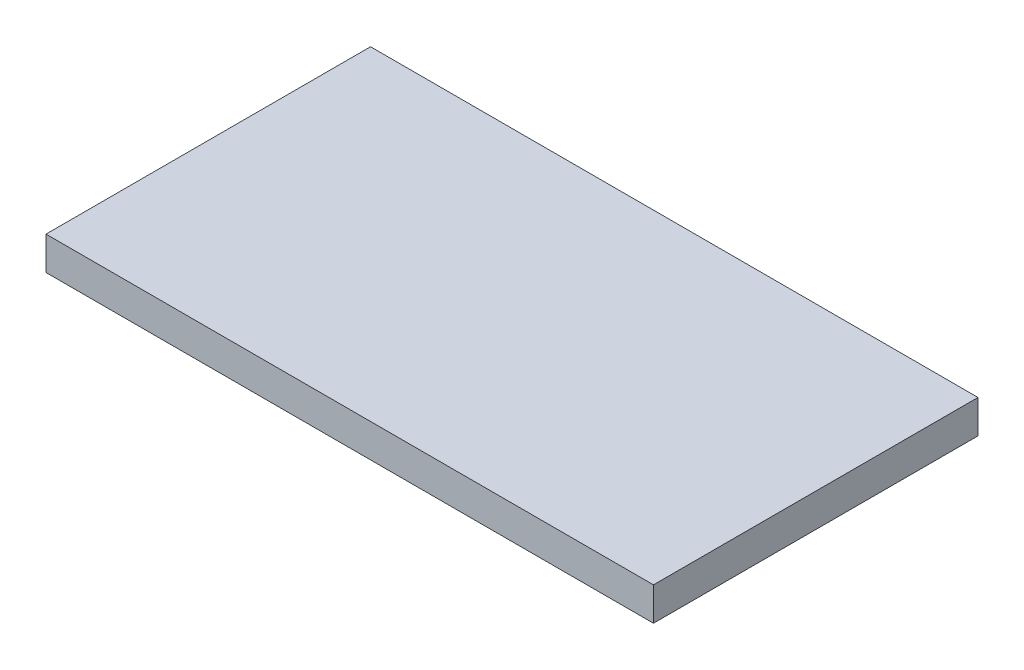
ISO-10303-21;
HEADER;
FILE_DESCRIPTION(('STEP AP214'),'2;1');
FILE_NAME('part.step','',(''),(''),'','','');
FILE_SCHEMA(('AUTOMOTIVE_DESIGN { 1 0 10303 214 1 1 1 1 }'));
ENDSEC;
DATA;
#1=APPLICATION_CONTEXT('core data for automotive mechanical design processes');
#2=APPLICATION_PROTOCOL_DEFINITION('international standard','automotive_design',2000,#1);
#3=PRODUCT_CONTEXT('',#1,'mechanical');
#4=PRODUCT('Part','Part','',(#3));
#5=PRODUCT_RELATED_PRODUCT_CATEGORY('part','',(#4));
#6=PRODUCT_DEFINITION_FORMATION('','',#4);
#7=PRODUCT_DEFINITION_CONTEXT('part definition',#1,'design');
#8=PRODUCT_DEFINITION('design','',#6,#7);
#9=PRODUCT_DEFINITION_SHAPE('','',#8);
#10=(LENGTH_UNIT() NAMED_UNIT(*) SI_UNIT(.MILLI.,.METRE.));
#11=(NAMED_UNIT(*) PLANE_ANGLE_UNIT() SI_UNIT($,.RADIAN.));
#12=(NAMED_UNIT(*) SI_UNIT($,.STERADIAN.) SOLID_ANGLE_UNIT());
#13=UNCERTAINTY_MEASURE_WITH_UNIT(LENGTH_MEASURE(1.E-05),#10,'distance_accuracy_value','');
#14=(GEOMETRIC_REPRESENTATION_CONTEXT(3) GLOBAL_UNCERTAINTY_ASSIGNED_CONTEXT((#13)) GLOBAL_UNIT_ASSIGNED_CONTEXT((#10,
#11,#12)) REPRESENTATION_CONTEXT('',''));
#15=CARTESIAN_POINT('',(0.,0.,0.));
#16=DIRECTION('',(0.,0.,1.));
#17=DIRECTION('',(1.,0.,0.));
#18=AXIS2_PLACEMENT_3D('',#15,#16,#17);
#19=CARTESIAN_POINT('',(18.25,2.,9.75));
#20=DIRECTION('',(-1.,0.,0.));
#21=DIRECTION('',(0.,0.,1.));
#22=AXIS2_PLACEMENT_3D('',#19,#20,#21);
#23=PLANE('',#22);
#24=DIRECTION('',(0.,0.,-1.));
#25=VECTOR('',#24,1.);
#26=CARTESIAN_POINT('',(18.25,0.,9.75));
#27=LINE('',#26,#25);
#28=CARTESIAN_POINT('',(18.25,0.,9.75));
#29=VERTEX_POINT('',#28);
#30=CARTESIAN_POINT('',(18.25,0.,-9.75));
#31=VERTEX_POINT('',#30);
#32=EDGE_CURVE('E96',#29,#31,#27,.T.);
#33=ORIENTED_EDGE('',*,*,#32,.T.);
#34=DIRECTION('',(0.,-1.,0.));
#35=VECTOR('',#34,1.);
#36=CARTESIAN_POINT('',(18.25,2.,-9.75));
#37=LINE('',#36,#35);
#38=CARTESIAN_POINT('',(18.25,2.,-9.75));
#39=VERTEX_POINT('',#38);
#40=EDGE_CURVE('E11',#39,#31,#37,.T.);
#41=ORIENTED_EDGE('',*,*,#40,.F.);
#42=DIRECTION('',(0.,0.,-1.));
#43=VECTOR('',#42,1.);
#44=CARTESIAN_POINT('',(18.25,2.,9.75));
#45=LINE('',#44,#43);
#46=CARTESIAN_POINT('',(18.25,2.,9.75));
#47=VERTEX_POINT('',#46);
#48=EDGE_CURVE('E84',#47,#39,#45,.T.);
#49=ORIENTED_EDGE('',*,*,#48,.F.);
#50=DIRECTION('',(0.,-1.,0.));
#51=VECTOR('',#50,1.);
#52=CARTESIAN_POINT('',(18.25,2.,9.75));
#53=LINE('',#52,#51);
#54=EDGE_CURVE('E92',#47,#29,#53,.T.);
#55=ORIENTED_EDGE('',*,*,#54,.T.);
#56=EDGE_LOOP('',(#33,#41,#49,#55));
#57=FACE_BOUND('',#56,.T.);
#58=ADVANCED_FACE('F33',(#57),#23,.F.);
#59=CARTESIAN_POINT('',(-18.25,2.,-9.75));
#60=DIRECTION('',(0.,0.,1.));
#61=DIRECTION('',(1.,0.,0.));
#62=AXIS2_PLACEMENT_3D('',#59,#60,#61);
#63=PLANE('',#62);
#64=DIRECTION('',(-1.,0.,0.));
#65=VECTOR('',#64,1.);
#66=CARTESIAN_POINT('',(-18.25,0.,-9.75));
#67=LINE('',#66,#65);
#68=CARTESIAN_POINT('',(-18.25,0.,-9.75));
#69=VERTEX_POINT('',#68);
#70=EDGE_CURVE('E88',#31,#69,#67,.T.);
#71=ORIENTED_EDGE('',*,*,#70,.T.);
#72=DIRECTION('',(0.,-1.,0.));
#73=VECTOR('',#72,1.);
#74=CARTESIAN_POINT('',(-18.25,2.,-9.75));
#75=LINE('',#74,#73);
#76=CARTESIAN_POINT('',(-18.25,2.,-9.75));
#77=VERTEX_POINT('',#76);
#78=EDGE_CURVE('E41',#77,#69,#75,.T.);
#79=ORIENTED_EDGE('',*,*,#78,.F.);
#80=DIRECTION('',(-1.,0.,0.));
#81=VECTOR('',#80,1.);
#82=CARTESIAN_POINT('',(-18.25,2.,-9.75));
#83=LINE('',#82,#81);
#84=EDGE_CURVE('E79',#39,#77,#83,.T.);
#85=ORIENTED_EDGE('',*,*,#84,.F.);
#86=ORIENTED_EDGE('',*,*,#40,.T.);
#87=EDGE_LOOP('',(#71,#79,#85,#86));
#88=FACE_BOUND('',#87,.T.);
#89=ADVANCED_FACE('F87',(#88),#63,.F.);
#90=CARTESIAN_POINT('',(-18.25,2.,9.75));
#91=DIRECTION('',(1.,0.,0.));
#92=DIRECTION('',(0.,0.,-1.));
#93=AXIS2_PLACEMENT_3D('',#90,#91,#92);
#94=PLANE('',#93);
#95=DIRECTION('',(0.,0.,1.));
#96=VECTOR('',#95,1.);
#97=CARTESIAN_POINT('',(-18.25,0.,9.75));
#98=LINE('',#97,#96);
#99=CARTESIAN_POINT('',(-18.25,0.,9.75));
#100=VERTEX_POINT('',#99);
#101=EDGE_CURVE('E66',#69,#100,#98,.T.);
#102=ORIENTED_EDGE('',*,*,#101,.T.);
#103=DIRECTION('',(0.,-1.,0.));
#104=VECTOR('',#103,1.);
#105=CARTESIAN_POINT('',(-18.25,2.,9.75));
#106=LINE('',#105,#104);
#107=CARTESIAN_POINT('',(-18.25,2.,9.75));
#108=VERTEX_POINT('',#107);
#109=EDGE_CURVE('E89',#108,#100,#106,.T.);
#110=ORIENTED_EDGE('',*,*,#109,.F.);
#111=DIRECTION('',(0.,0.,1.));
#112=VECTOR('',#111,1.);
#113=CARTESIAN_POINT('',(-18.25,2.,9.75));
#114=LINE('',#113,#112);
#115=EDGE_CURVE('E82',#77,#108,#114,.T.);
#116=ORIENTED_EDGE('',*,*,#115,.F.);
#117=ORIENTED_EDGE('',*,*,#78,.T.);
#118=EDGE_LOOP('',(#102,#110,#116,#117));
#119=FACE_BOUND('',#118,.T.);
#120=ADVANCED_FACE('F90',(#119),#94,.F.);
#121=CARTESIAN_POINT('',(-18.25,2.,9.75));
#122=DIRECTION('',(0.,0.,-1.));
#123=DIRECTION('',(-1.,0.,0.));
#124=AXIS2_PLACEMENT_3D('',#121,#122,#123);
#125=PLANE('',#124);
#126=DIRECTION('',(1.,0.,0.));
#127=VECTOR('',#126,1.);
#128=CARTESIAN_POINT('',(-18.25,0.,9.75));
#129=LINE('',#128,#127);
#130=EDGE_CURVE('E72',#100,#29,#129,.T.);
#131=ORIENTED_EDGE('',*,*,#130,.T.);
#132=ORIENTED_EDGE('',*,*,#54,.F.);
#133=DIRECTION('',(1.,0.,0.));
#134=VECTOR('',#133,1.);
#135=CARTESIAN_POINT('',(-18.25,2.,9.75));
#136=LINE('',#135,#134);
#137=EDGE_CURVE('E49',#108,#47,#136,.T.);
#138=ORIENTED_EDGE('',*,*,#137,.F.);
#139=ORIENTED_EDGE('',*,*,#109,.T.);
#140=EDGE_LOOP('',(#131,#132,#138,#139));
#141=FACE_BOUND('',#140,.T.);
#142=ADVANCED_FACE('F103',(#141),#125,.F.);
#143=CARTESIAN_POINT('',(0.,2.,0.));
#144=DIRECTION('',(0.,-1.,0.));
#145=DIRECTION('',(0.,0.,-1.));
#146=AXIS2_PLACEMENT_3D('',#143,#144,#145);
#147=PLANE('',#146);
#148=ORIENTED_EDGE('',*,*,#48,.T.);
#149=ORIENTED_EDGE('',*,*,#84,.T.);
#150=ORIENTED_EDGE('',*,*,#115,.T.);
#151=ORIENTED_EDGE('',*,*,#137,.T.);
#152=EDGE_LOOP('',(#148,#149,#150,#151));
#153=FACE_BOUND('',#152,.T.);
#154=ADVANCED_FACE('F80',(#153),#147,.F.);
#155=CARTESIAN_POINT('',(0.,0.,0.));
#156=DIRECTION('',(0.,-1.,0.));
#157=DIRECTION('',(0.,0.,-1.));
#158=AXIS2_PLACEMENT_3D('',#155,#156,#157);
#159=PLANE('',#158);
#160=ORIENTED_EDGE('',*,*,#32,.F.);
#161=ORIENTED_EDGE('',*,*,#130,.F.);
#162=ORIENTED_EDGE('',*,*,#101,.F.);
#163=ORIENTED_EDGE('',*,*,#70,.F.);
#164=EDGE_LOOP('',(#160,#161,#162,#163));
#165=FACE_BOUND('',#164,.T.);
#166=ADVANCED_FACE('F106',(#165),#159,.T.);
#167=CLOSED_SHELL('',(#58,#89,#120,#142,#154,#166));
#168=MANIFOLD_SOLID_BREP('B2',#167);
#169=ADVANCED_BREP_SHAPE_REPRESENTATION('',(#18,#168),#14);
#170=SHAPE_DEFINITION_REPRESENTATION(#9,#169);
ENDSEC;
END-ISO-10303-21;
